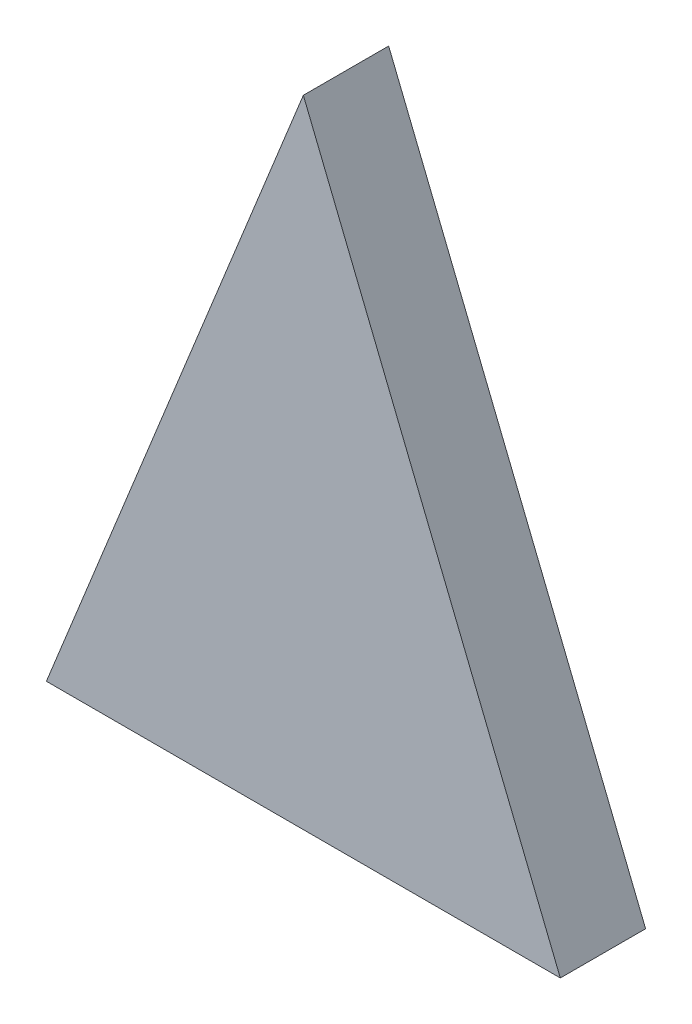
ISO-10303-21;
HEADER;
FILE_DESCRIPTION(('STEP AP214'),'2;1');
FILE_NAME('part.step','',(''),(''),'','','');
FILE_SCHEMA(('AUTOMOTIVE_DESIGN { 1 0 10303 214 1 1 1 1 }'));
ENDSEC;
DATA;
#1=APPLICATION_CONTEXT('core data for automotive mechanical design processes');
#2=APPLICATION_PROTOCOL_DEFINITION('international standard','automotive_design',2000,#1);
#3=PRODUCT_CONTEXT('',#1,'mechanical');
#4=PRODUCT('Part','Part','',(#3));
#5=PRODUCT_RELATED_PRODUCT_CATEGORY('part','',(#4));
#6=PRODUCT_DEFINITION_FORMATION('','',#4);
#7=PRODUCT_DEFINITION_CONTEXT('part definition',#1,'design');
#8=PRODUCT_DEFINITION('design','',#6,#7);
#9=PRODUCT_DEFINITION_SHAPE('','',#8);
#10=(LENGTH_UNIT() NAMED_UNIT(*) SI_UNIT(.MILLI.,.METRE.));
#11=(NAMED_UNIT(*) PLANE_ANGLE_UNIT() SI_UNIT($,.RADIAN.));
#12=(NAMED_UNIT(*) SI_UNIT($,.STERADIAN.) SOLID_ANGLE_UNIT());
#13=UNCERTAINTY_MEASURE_WITH_UNIT(LENGTH_MEASURE(1.E-05),#10,'distance_accuracy_value','');
#14=(GEOMETRIC_REPRESENTATION_CONTEXT(3) GLOBAL_UNCERTAINTY_ASSIGNED_CONTEXT((#13)) GLOBAL_UNIT_ASSIGNED_CONTEXT((#10,
#11,#12)) REPRESENTATION_CONTEXT('',''));
#15=CARTESIAN_POINT('',(0.,0.,0.));
#16=DIRECTION('',(0.,0.,1.));
#17=DIRECTION('',(1.,0.,0.));
#18=AXIS2_PLACEMENT_3D('',#15,#16,#17);
#19=CARTESIAN_POINT('',(0.198225571839861,-0.56437912510646,0.));
#20=DIRECTION('',(0.927183854566512,0.374606593416594,0.));
#21=DIRECTION('',(-0.374606593416594,0.927183854566512,0.));
#22=AXIS2_PLACEMENT_3D('',#19,#20,#21);
#23=PLANE('',#22);
#24=DIRECTION('',(-0.374606593416594,0.927183854566512,0.));
#25=VECTOR('',#24,1.);
#26=CARTESIAN_POINT('',(0.198225571839861,-0.56437912510646,0.));
#27=LINE('',#26,#25);
#28=CARTESIAN_POINT('',(0.198225571839861,-0.56437912510646,0.));
#29=VERTEX_POINT('',#28);
#30=CARTESIAN_POINT('',(0.189188093691386,-0.54201058175318,0.));
#31=VERTEX_POINT('',#30);
#32=EDGE_CURVE('E11',#29,#31,#27,.T.);
#33=ORIENTED_EDGE('',*,*,#32,.T.);
#34=DIRECTION('',(0.,0.,1.));
#35=VECTOR('',#34,1.);
#36=CARTESIAN_POINT('',(0.189188093691386,-0.54201058175318,0.));
#37=LINE('',#36,#35);
#38=CARTESIAN_POINT('',(0.189188093691386,-0.54201058175318,0.003));
#39=VERTEX_POINT('',#38);
#40=EDGE_CURVE('E24',#31,#39,#37,.T.);
#41=ORIENTED_EDGE('',*,*,#40,.T.);
#42=DIRECTION('',(-0.374606593416594,0.927183854566512,0.));
#43=VECTOR('',#42,1.);
#44=CARTESIAN_POINT('',(0.198225571839861,-0.56437912510646,0.003));
#45=LINE('',#44,#43);
#46=CARTESIAN_POINT('',(0.198225571839861,-0.56437912510646,0.003));
#47=VERTEX_POINT('',#46);
#48=EDGE_CURVE('E67',#47,#39,#45,.T.);
#49=ORIENTED_EDGE('',*,*,#48,.F.);
#50=DIRECTION('',(0.,0.,1.));
#51=VECTOR('',#50,1.);
#52=CARTESIAN_POINT('',(0.198225571839861,-0.56437912510646,0.));
#53=LINE('',#52,#51);
#54=EDGE_CURVE('E54',#29,#47,#53,.T.);
#55=ORIENTED_EDGE('',*,*,#54,.F.);
#56=EDGE_LOOP('',(#33,#41,#49,#55));
#57=FACE_BOUND('',#56,.T.);
#58=ADVANCED_FACE('F17',(#57),#23,.T.);
#59=CARTESIAN_POINT('',(0.180150615542996,-0.56437912510646,0.));
#60=DIRECTION('',(0.,-1.,0.));
#61=DIRECTION('',(1.,0.,0.));
#62=AXIS2_PLACEMENT_3D('',#59,#60,#61);
#63=PLANE('',#62);
#64=DIRECTION('',(1.,0.,0.));
#65=VECTOR('',#64,1.);
#66=CARTESIAN_POINT('',(0.180150615542996,-0.56437912510646,0.));
#67=LINE('',#66,#65);
#68=CARTESIAN_POINT('',(0.180150615542996,-0.56437912510646,0.));
#69=VERTEX_POINT('',#68);
#70=EDGE_CURVE('E58',#69,#29,#67,.T.);
#71=ORIENTED_EDGE('',*,*,#70,.T.);
#72=ORIENTED_EDGE('',*,*,#54,.T.);
#73=DIRECTION('',(1.,0.,0.));
#74=VECTOR('',#73,1.);
#75=CARTESIAN_POINT('',(0.180150615542996,-0.56437912510646,0.003));
#76=LINE('',#75,#74);
#77=CARTESIAN_POINT('',(0.180150615542996,-0.56437912510646,0.003));
#78=VERTEX_POINT('',#77);
#79=EDGE_CURVE('E48',#78,#47,#76,.T.);
#80=ORIENTED_EDGE('',*,*,#79,.F.);
#81=DIRECTION('',(0.,0.,1.));
#82=VECTOR('',#81,1.);
#83=CARTESIAN_POINT('',(0.180150615542996,-0.56437912510646,0.));
#84=LINE('',#83,#82);
#85=EDGE_CURVE('E52',#69,#78,#84,.T.);
#86=ORIENTED_EDGE('',*,*,#85,.F.);
#87=EDGE_LOOP('',(#71,#72,#80,#86));
#88=FACE_BOUND('',#87,.T.);
#89=ADVANCED_FACE('F51',(#88),#63,.T.);
#90=CARTESIAN_POINT('',(0.189188093691386,-0.54201058175318,0.));
#91=DIRECTION('',(-0.927183854567735,0.374606593413568,0.));
#92=DIRECTION('',(-0.374606593413568,-0.927183854567735,0.));
#93=AXIS2_PLACEMENT_3D('',#90,#91,#92);
#94=PLANE('',#93);
#95=DIRECTION('',(-0.374606593413568,-0.927183854567735,0.));
#96=VECTOR('',#95,1.);
#97=CARTESIAN_POINT('',(0.189188093691386,-0.54201058175318,0.));
#98=LINE('',#97,#96);
#99=EDGE_CURVE('E64',#31,#69,#98,.T.);
#100=ORIENTED_EDGE('',*,*,#99,.T.);
#101=ORIENTED_EDGE('',*,*,#85,.T.);
#102=DIRECTION('',(-0.374606593413568,-0.927183854567735,0.));
#103=VECTOR('',#102,1.);
#104=CARTESIAN_POINT('',(0.189188093691386,-0.54201058175318,0.003));
#105=LINE('',#104,#103);
#106=EDGE_CURVE('E63',#39,#78,#105,.T.);
#107=ORIENTED_EDGE('',*,*,#106,.F.);
#108=ORIENTED_EDGE('',*,*,#40,.F.);
#109=EDGE_LOOP('',(#100,#101,#107,#108));
#110=FACE_BOUND('',#109,.T.);
#111=ADVANCED_FACE('F62',(#110),#94,.T.);
#112=CARTESIAN_POINT('',(0.189188093691429,-0.55319485342982,0.003));
#113=DIRECTION('',(0.,0.,1.));
#114=DIRECTION('',(1.,0.,0.));
#115=AXIS2_PLACEMENT_3D('',#112,#113,#114);
#116=PLANE('',#115);
#117=ORIENTED_EDGE('',*,*,#106,.T.);
#118=ORIENTED_EDGE('',*,*,#79,.T.);
#119=ORIENTED_EDGE('',*,*,#48,.T.);
#120=EDGE_LOOP('',(#117,#118,#119));
#121=FACE_BOUND('',#120,.T.);
#122=ADVANCED_FACE('F66',(#121),#116,.T.);
#123=CARTESIAN_POINT('',(0.189188093691429,-0.55319485342982,0.));
#124=DIRECTION('',(0.,0.,1.));
#125=DIRECTION('',(1.,0.,0.));
#126=AXIS2_PLACEMENT_3D('',#123,#124,#125);
#127=PLANE('',#126);
#128=ORIENTED_EDGE('',*,*,#99,.F.);
#129=ORIENTED_EDGE('',*,*,#32,.F.);
#130=ORIENTED_EDGE('',*,*,#70,.F.);
#131=EDGE_LOOP('',(#128,#129,#130));
#132=FACE_BOUND('',#131,.T.);
#133=ADVANCED_FACE('F73',(#132),#127,.F.);
#134=CLOSED_SHELL('',(#58,#89,#111,#122,#133));
#135=MANIFOLD_SOLID_BREP('B1',#134);
#136=ADVANCED_BREP_SHAPE_REPRESENTATION('',(#18,#135),#14);
#137=SHAPE_DEFINITION_REPRESENTATION(#9,#136);
ENDSEC;
END-ISO-10303-21;
